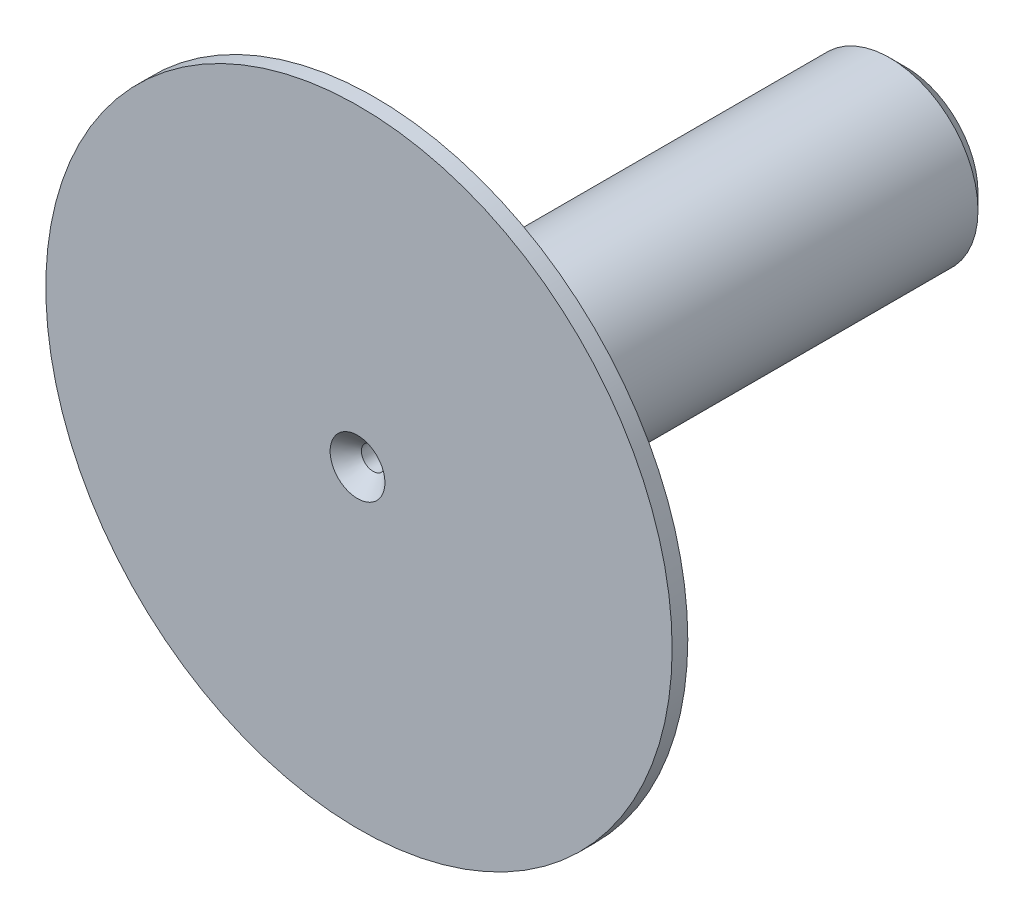
ISO-10303-21;
HEADER;
FILE_DESCRIPTION(('STEP AP214'),'2;1');
FILE_NAME('part.step','',(''),(''),'','','');
FILE_SCHEMA(('AUTOMOTIVE_DESIGN { 1 0 10303 214 1 1 1 1 }'));
ENDSEC;
DATA;
#1=APPLICATION_CONTEXT('core data for automotive mechanical design processes');
#2=APPLICATION_PROTOCOL_DEFINITION('international standard','automotive_design',2000,#1);
#3=PRODUCT_CONTEXT('',#1,'mechanical');
#4=PRODUCT('Part','Part','',(#3));
#5=PRODUCT_RELATED_PRODUCT_CATEGORY('part','',(#4));
#6=PRODUCT_DEFINITION_FORMATION('','',#4);
#7=PRODUCT_DEFINITION_CONTEXT('part definition',#1,'design');
#8=PRODUCT_DEFINITION('design','',#6,#7);
#9=PRODUCT_DEFINITION_SHAPE('','',#8);
#10=(LENGTH_UNIT() NAMED_UNIT(*) SI_UNIT(.MILLI.,.METRE.));
#11=(NAMED_UNIT(*) PLANE_ANGLE_UNIT() SI_UNIT($,.RADIAN.));
#12=(NAMED_UNIT(*) SI_UNIT($,.STERADIAN.) SOLID_ANGLE_UNIT());
#13=UNCERTAINTY_MEASURE_WITH_UNIT(LENGTH_MEASURE(1.E-05),#10,'distance_accuracy_value','');
#14=(GEOMETRIC_REPRESENTATION_CONTEXT(3) GLOBAL_UNCERTAINTY_ASSIGNED_CONTEXT((#13)) GLOBAL_UNIT_ASSIGNED_CONTEXT((#10,
#11,#12)) REPRESENTATION_CONTEXT('',''));
#15=CARTESIAN_POINT('',(0.,0.,0.));
#16=DIRECTION('',(0.,0.,1.));
#17=DIRECTION('',(1.,0.,0.));
#18=AXIS2_PLACEMENT_3D('',#15,#16,#17);
#19=CARTESIAN_POINT('',(0.,0.,7.));
#20=DIRECTION('',(0.,0.,-1.));
#21=DIRECTION('',(-1.,0.,0.));
#22=AXIS2_PLACEMENT_3D('',#19,#20,#21);
#23=CYLINDRICAL_SURFACE('',#22,1.125);
#24=CARTESIAN_POINT('',(0.,0.,0.199999999999997));
#25=DIRECTION('',(0.,0.,1.));
#26=DIRECTION('',(1.,0.,0.));
#27=AXIS2_PLACEMENT_3D('',#24,#25,#26);
#28=CIRCLE('',#27,1.125);
#29=CARTESIAN_POINT('',(1.125,0.,0.199999999999997));
#30=VERTEX_POINT('',#29);
#31=EDGE_CURVE('E65',#30,#30,#28,.T.);
#32=ORIENTED_EDGE('',*,*,#31,.T.);
#33=EDGE_LOOP('',(#32));
#34=FACE_BOUND('',#33,.T.);
#35=CARTESIAN_POINT('',(0.,0.,6.8));
#36=DIRECTION('',(0.,0.,1.));
#37=DIRECTION('',(1.,0.,0.));
#38=AXIS2_PLACEMENT_3D('',#35,#36,#37);
#39=CIRCLE('',#38,1.125);
#40=CARTESIAN_POINT('',(1.125,0.,6.8));
#41=VERTEX_POINT('',#40);
#42=EDGE_CURVE('E68',#41,#41,#39,.T.);
#43=ORIENTED_EDGE('',*,*,#42,.F.);
#44=EDGE_LOOP('',(#43));
#45=FACE_BOUND('',#44,.T.);
#46=ADVANCED_FACE('F41',(#34,#45),#23,.T.);
#47=CARTESIAN_POINT('',(0.,0.,7.));
#48=DIRECTION('',(0.,0.,1.));
#49=DIRECTION('',(1.,0.,0.));
#50=AXIS2_PLACEMENT_3D('',#47,#48,#49);
#51=PLANE('',#50);
#52=CARTESIAN_POINT('',(0.,0.,7.));
#53=DIRECTION('',(0.,0.,1.));
#54=DIRECTION('',(1.,0.,0.));
#55=AXIS2_PLACEMENT_3D('',#52,#53,#54);
#56=CIRCLE('',#55,0.350000000000001);
#57=CARTESIAN_POINT('',(0.350000000000001,0.,7.));
#58=VERTEX_POINT('',#57);
#59=EDGE_CURVE('E10',#58,#58,#56,.F.);
#60=ORIENTED_EDGE('',*,*,#59,.T.);
#61=EDGE_LOOP('',(#60));
#62=FACE_BOUND('',#61,.T.);
#63=CARTESIAN_POINT('',(0.0186698824009481,0.,7.));
#64=DIRECTION('',(0.,0.,1.));
#65=DIRECTION('',(1.,0.,0.));
#66=AXIS2_PLACEMENT_3D('',#63,#64,#65);
#67=CIRCLE('',#66,4.);
#68=CARTESIAN_POINT('',(4.01866988240095,0.,7.));
#69=VERTEX_POINT('',#68);
#70=EDGE_CURVE('E72',#69,#69,#67,.T.);
#71=ORIENTED_EDGE('',*,*,#70,.T.);
#72=EDGE_LOOP('',(#71));
#73=FACE_BOUND('',#72,.T.);
#74=ADVANCED_FACE('F96',(#62,#73),#51,.T.);
#75=CARTESIAN_POINT('',(0.,0.,0.));
#76=DIRECTION('',(0.,0.,1.));
#77=DIRECTION('',(1.,0.,0.));
#78=AXIS2_PLACEMENT_3D('',#75,#76,#77);
#79=PLANE('',#78);
#80=CARTESIAN_POINT('',(0.,0.,0.));
#81=DIRECTION('',(0.,0.,1.));
#82=DIRECTION('',(1.,0.,0.));
#83=AXIS2_PLACEMENT_3D('',#80,#81,#82);
#84=CIRCLE('',#83,0.925);
#85=CARTESIAN_POINT('',(0.925,0.,0.));
#86=VERTEX_POINT('',#85);
#87=EDGE_CURVE('E57',#86,#86,#84,.F.);
#88=ORIENTED_EDGE('',*,*,#87,.T.);
#89=EDGE_LOOP('',(#88));
#90=FACE_BOUND('',#89,.T.);
#91=CARTESIAN_POINT('',(0.,0.,0.));
#92=DIRECTION('',(0.,0.,1.));
#93=DIRECTION('',(1.,0.,0.));
#94=AXIS2_PLACEMENT_3D('',#91,#92,#93);
#95=CIRCLE('',#94,0.350000000000001);
#96=CARTESIAN_POINT('',(0.350000000000001,0.,0.));
#97=VERTEX_POINT('',#96);
#98=EDGE_CURVE('E62',#97,#97,#95,.T.);
#99=ORIENTED_EDGE('',*,*,#98,.T.);
#100=EDGE_LOOP('',(#99));
#101=FACE_BOUND('',#100,.T.);
#102=ADVANCED_FACE('F102',(#90,#101),#79,.F.);
#103=CARTESIAN_POINT('',(0.,0.,7.));
#104=DIRECTION('',(0.,0.,-1.));
#105=DIRECTION('',(-1.,0.,0.));
#106=AXIS2_PLACEMENT_3D('',#103,#104,#105);
#107=CYLINDRICAL_SURFACE('',#106,0.15);
#108=CARTESIAN_POINT('',(0.,0.,0.200000000000001));
#109=DIRECTION('',(0.,0.,1.));
#110=DIRECTION('',(1.,0.,0.));
#111=AXIS2_PLACEMENT_3D('',#108,#109,#110);
#112=CIRCLE('',#111,0.15);
#113=CARTESIAN_POINT('',(0.15,0.,0.200000000000001));
#114=VERTEX_POINT('',#113);
#115=EDGE_CURVE('E49',#114,#114,#112,.F.);
#116=ORIENTED_EDGE('',*,*,#115,.T.);
#117=EDGE_LOOP('',(#116));
#118=FACE_BOUND('',#117,.T.);
#119=CARTESIAN_POINT('',(0.,0.,6.8));
#120=DIRECTION('',(0.,0.,1.));
#121=DIRECTION('',(1.,0.,0.));
#122=AXIS2_PLACEMENT_3D('',#119,#120,#121);
#123=CIRCLE('',#122,0.15);
#124=CARTESIAN_POINT('',(0.15,0.,6.8));
#125=VERTEX_POINT('',#124);
#126=EDGE_CURVE('E53',#125,#125,#123,.T.);
#127=ORIENTED_EDGE('',*,*,#126,.T.);
#128=EDGE_LOOP('',(#127));
#129=FACE_BOUND('',#128,.T.);
#130=ADVANCED_FACE('F94',(#118,#129),#107,.F.);
#131=CARTESIAN_POINT('',(0.0186698824009481,0.,6.8));
#132=DIRECTION('',(0.,0.,1.));
#133=DIRECTION('',(1.,0.,0.));
#134=AXIS2_PLACEMENT_3D('',#131,#132,#133);
#135=CYLINDRICAL_SURFACE('',#134,4.);
#136=CARTESIAN_POINT('',(0.0186698824009481,0.,6.8));
#137=DIRECTION('',(0.,0.,1.));
#138=DIRECTION('',(1.,0.,0.));
#139=AXIS2_PLACEMENT_3D('',#136,#137,#138);
#140=CIRCLE('',#139,4.);
#141=CARTESIAN_POINT('',(4.01866988240095,0.,6.8));
#142=VERTEX_POINT('',#141);
#143=EDGE_CURVE('E71',#142,#142,#140,.T.);
#144=ORIENTED_EDGE('',*,*,#143,.T.);
#145=EDGE_LOOP('',(#144));
#146=FACE_BOUND('',#145,.T.);
#147=ORIENTED_EDGE('',*,*,#70,.F.);
#148=EDGE_LOOP('',(#147));
#149=FACE_BOUND('',#148,.T.);
#150=ADVANCED_FACE('F78',(#146,#149),#135,.T.);
#151=CARTESIAN_POINT('',(0.0186698824009481,0.,6.8));
#152=DIRECTION('',(0.,0.,1.));
#153=DIRECTION('',(1.,0.,0.));
#154=AXIS2_PLACEMENT_3D('',#151,#152,#153);
#155=PLANE('',#154);
#156=ORIENTED_EDGE('',*,*,#42,.T.);
#157=EDGE_LOOP('',(#156));
#158=FACE_BOUND('',#157,.T.);
#159=ORIENTED_EDGE('',*,*,#143,.F.);
#160=EDGE_LOOP('',(#159));
#161=FACE_BOUND('',#160,.T.);
#162=ADVANCED_FACE('F81',(#158,#161),#155,.F.);
#163=CARTESIAN_POINT('',(0.,0.,0.199999999999997));
#164=DIRECTION('',(0.,0.,1.));
#165=DIRECTION('',(1.,0.,0.));
#166=AXIS2_PLACEMENT_3D('',#163,#164,#165);
#167=CONICAL_SURFACE('',#166,1.125,0.785398163397454);
#168=ORIENTED_EDGE('',*,*,#87,.F.);
#169=EDGE_LOOP('',(#168));
#170=FACE_BOUND('',#169,.T.);
#171=ORIENTED_EDGE('',*,*,#31,.F.);
#172=EDGE_LOOP('',(#171));
#173=FACE_BOUND('',#172,.T.);
#174=ADVANCED_FACE('F83',(#170,#173),#167,.T.);
#175=CARTESIAN_POINT('',(0.,0.,0.));
#176=DIRECTION('',(0.,0.,-1.));
#177=DIRECTION('',(-1.,0.,0.));
#178=AXIS2_PLACEMENT_3D('',#175,#176,#177);
#179=CONICAL_SURFACE('',#178,0.350000000000001,0.78539816339745);
#180=ORIENTED_EDGE('',*,*,#115,.F.);
#181=EDGE_LOOP('',(#180));
#182=FACE_BOUND('',#181,.T.);
#183=ORIENTED_EDGE('',*,*,#98,.F.);
#184=EDGE_LOOP('',(#183));
#185=FACE_BOUND('',#184,.T.);
#186=ADVANCED_FACE('F91',(#182,#185),#179,.F.);
#187=CARTESIAN_POINT('',(0.,0.,6.8));
#188=DIRECTION('',(0.,0.,1.));
#189=DIRECTION('',(1.,0.,0.));
#190=AXIS2_PLACEMENT_3D('',#187,#188,#189);
#191=CONICAL_SURFACE('',#190,0.15,0.78539816339745);
#192=ORIENTED_EDGE('',*,*,#59,.F.);
#193=EDGE_LOOP('',(#192));
#194=FACE_BOUND('',#193,.T.);
#195=ORIENTED_EDGE('',*,*,#126,.F.);
#196=EDGE_LOOP('',(#195));
#197=FACE_BOUND('',#196,.T.);
#198=ADVANCED_FACE('F44',(#194,#197),#191,.F.);
#199=CLOSED_SHELL('',(#46,#74,#102,#130,#150,#162,#174,#186,#198));
#200=MANIFOLD_SOLID_BREP('B2',#199);
#201=ADVANCED_BREP_SHAPE_REPRESENTATION('',(#18,#200),#14);
#202=SHAPE_DEFINITION_REPRESENTATION(#9,#201);
ENDSEC;
END-ISO-10303-21;
